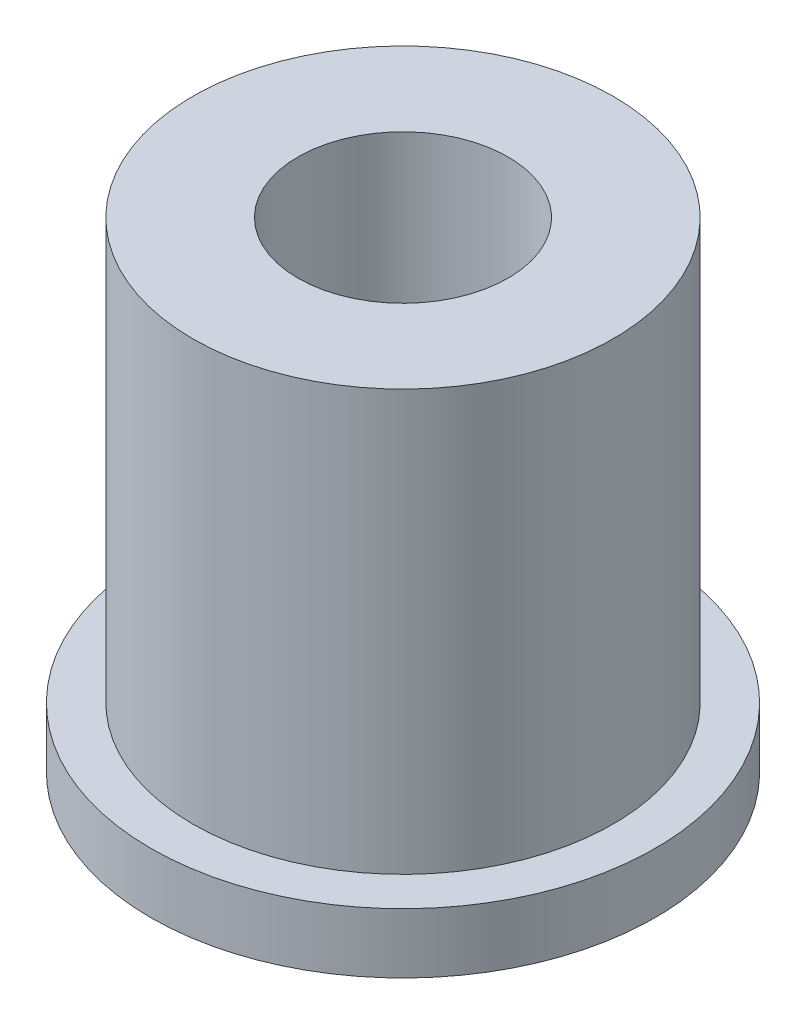
ISO-10303-21;
HEADER;
FILE_DESCRIPTION(('STEP AP214'),'2;1');
FILE_NAME('part.step','',(''),(''),'','','');
FILE_SCHEMA(('AUTOMOTIVE_DESIGN { 1 0 10303 214 1 1 1 1 }'));
ENDSEC;
DATA;
#1=APPLICATION_CONTEXT('core data for automotive mechanical design processes');
#2=APPLICATION_PROTOCOL_DEFINITION('international standard','automotive_design',2000,#1);
#3=PRODUCT_CONTEXT('',#1,'mechanical');
#4=PRODUCT('Part','Part','',(#3));
#5=PRODUCT_RELATED_PRODUCT_CATEGORY('part','',(#4));
#6=PRODUCT_DEFINITION_FORMATION('','',#4);
#7=PRODUCT_DEFINITION_CONTEXT('part definition',#1,'design');
#8=PRODUCT_DEFINITION('design','',#6,#7);
#9=PRODUCT_DEFINITION_SHAPE('','',#8);
#10=(LENGTH_UNIT() NAMED_UNIT(*) SI_UNIT(.MILLI.,.METRE.));
#11=(NAMED_UNIT(*) PLANE_ANGLE_UNIT() SI_UNIT($,.RADIAN.));
#12=(NAMED_UNIT(*) SI_UNIT($,.STERADIAN.) SOLID_ANGLE_UNIT());
#13=UNCERTAINTY_MEASURE_WITH_UNIT(LENGTH_MEASURE(1.E-05),#10,'distance_accuracy_value','');
#14=(GEOMETRIC_REPRESENTATION_CONTEXT(3) GLOBAL_UNCERTAINTY_ASSIGNED_CONTEXT((#13)) GLOBAL_UNIT_ASSIGNED_CONTEXT((#10,
#11,#12)) REPRESENTATION_CONTEXT('',''));
#15=CARTESIAN_POINT('',(0.,0.,0.));
#16=DIRECTION('',(0.,0.,1.));
#17=DIRECTION('',(1.,0.,0.));
#18=AXIS2_PLACEMENT_3D('',#15,#16,#17);
#19=CARTESIAN_POINT('',(0.,5.,0.));
#20=DIRECTION('',(0.,1.,0.));
#21=DIRECTION('',(0.,0.,1.));
#22=AXIS2_PLACEMENT_3D('',#19,#20,#21);
#23=PLANE('',#22);
#24=CARTESIAN_POINT('',(0.,5.,0.));
#25=DIRECTION('',(0.,1.,0.));
#26=DIRECTION('',(0.,0.,1.));
#27=AXIS2_PLACEMENT_3D('',#24,#25,#26);
#28=CIRCLE('',#27,21.);
#29=CARTESIAN_POINT('',(0.,5.,21.));
#30=VERTEX_POINT('',#29);
#31=EDGE_CURVE('E10',#30,#30,#28,.T.);
#32=ORIENTED_EDGE('',*,*,#31,.T.);
#33=EDGE_LOOP('',(#32));
#34=FACE_BOUND('',#33,.T.);
#35=CARTESIAN_POINT('',(0.,5.,0.));
#36=DIRECTION('',(0.,1.,0.));
#37=DIRECTION('',(0.,0.,1.));
#38=AXIS2_PLACEMENT_3D('',#35,#36,#37);
#39=CIRCLE('',#38,17.5);
#40=CARTESIAN_POINT('',(0.,5.,17.5));
#41=VERTEX_POINT('',#40);
#42=EDGE_CURVE('E88',#41,#41,#39,.T.);
#43=ORIENTED_EDGE('',*,*,#42,.F.);
#44=EDGE_LOOP('',(#43));
#45=FACE_BOUND('',#44,.T.);
#46=ADVANCED_FACE('F30',(#34,#45),#23,.T.);
#47=CARTESIAN_POINT('',(0.,0.,0.));
#48=DIRECTION('',(0.,1.,0.));
#49=DIRECTION('',(0.,0.,1.));
#50=AXIS2_PLACEMENT_3D('',#47,#48,#49);
#51=PLANE('',#50);
#52=CARTESIAN_POINT('',(-8.83883476483189,0.,-8.8388347648318));
#53=DIRECTION('',(0.,-1.,0.));
#54=DIRECTION('',(0.,0.,-1.));
#55=AXIS2_PLACEMENT_3D('',#52,#53,#54);
#56=CIRCLE('',#55,1.6);
#57=CARTESIAN_POINT('',(-8.83883476483189,0.,-10.4388347648318));
#58=VERTEX_POINT('',#57);
#59=EDGE_CURVE('E82',#58,#58,#56,.T.);
#60=ORIENTED_EDGE('',*,*,#59,.F.);
#61=EDGE_LOOP('',(#60));
#62=FACE_BOUND('',#61,.T.);
#63=CARTESIAN_POINT('',(8.83883476483189,0.,8.83883476483179));
#64=DIRECTION('',(0.,-1.,0.));
#65=DIRECTION('',(0.,0.,-1.));
#66=AXIS2_PLACEMENT_3D('',#63,#64,#65);
#67=CIRCLE('',#66,1.6);
#68=CARTESIAN_POINT('',(8.83883476483189,0.,7.23883476483179));
#69=VERTEX_POINT('',#68);
#70=EDGE_CURVE('E76',#69,#69,#67,.T.);
#71=ORIENTED_EDGE('',*,*,#70,.F.);
#72=EDGE_LOOP('',(#71));
#73=FACE_BOUND('',#72,.T.);
#74=CARTESIAN_POINT('',(7.49999999999988,0.,-12.9903810567667));
#75=DIRECTION('',(0.,-1.,0.));
#76=DIRECTION('',(0.,0.,-1.));
#77=AXIS2_PLACEMENT_3D('',#74,#75,#76);
#78=CIRCLE('',#77,1.6);
#79=CARTESIAN_POINT('',(7.49999999999988,0.,-14.5903810567667));
#80=VERTEX_POINT('',#79);
#81=EDGE_CURVE('E70',#80,#80,#78,.T.);
#82=ORIENTED_EDGE('',*,*,#81,.F.);
#83=EDGE_LOOP('',(#82));
#84=FACE_BOUND('',#83,.T.);
#85=CARTESIAN_POINT('',(7.50000000000006,0.,12.9903810567665));
#86=DIRECTION('',(0.,-1.,0.));
#87=DIRECTION('',(0.,0.,-1.));
#88=AXIS2_PLACEMENT_3D('',#85,#86,#87);
#89=CIRCLE('',#88,1.6);
#90=CARTESIAN_POINT('',(7.50000000000006,0.,11.3903810567665));
#91=VERTEX_POINT('',#90);
#92=EDGE_CURVE('E64',#91,#91,#89,.T.);
#93=ORIENTED_EDGE('',*,*,#92,.F.);
#94=EDGE_LOOP('',(#93));
#95=FACE_BOUND('',#94,.T.);
#96=CARTESIAN_POINT('',(-15.,0.,0.));
#97=DIRECTION('',(0.,-1.,0.));
#98=DIRECTION('',(0.,0.,-1.));
#99=AXIS2_PLACEMENT_3D('',#96,#97,#98);
#100=CIRCLE('',#99,1.6);
#101=CARTESIAN_POINT('',(-15.,0.,-1.6));
#102=VERTEX_POINT('',#101);
#103=EDGE_CURVE('E58',#102,#102,#100,.T.);
#104=ORIENTED_EDGE('',*,*,#103,.F.);
#105=EDGE_LOOP('',(#104));
#106=FACE_BOUND('',#105,.T.);
#107=CARTESIAN_POINT('',(10.2530483272049,0.,-10.253048327205));
#108=DIRECTION('',(0.,-1.,0.));
#109=DIRECTION('',(0.,0.,-1.));
#110=AXIS2_PLACEMENT_3D('',#107,#108,#109);
#111=CIRCLE('',#110,2.1);
#112=CARTESIAN_POINT('',(10.2530483272049,0.,-12.353048327205));
#113=VERTEX_POINT('',#112);
#114=EDGE_CURVE('E52',#113,#113,#111,.T.);
#115=ORIENTED_EDGE('',*,*,#114,.F.);
#116=EDGE_LOOP('',(#115));
#117=FACE_BOUND('',#116,.T.);
#118=CARTESIAN_POINT('',(-10.2530483272049,0.,10.253048327205));
#119=DIRECTION('',(0.,-1.,0.));
#120=DIRECTION('',(0.,0.,-1.));
#121=AXIS2_PLACEMENT_3D('',#118,#119,#120);
#122=CIRCLE('',#121,2.1);
#123=CARTESIAN_POINT('',(-10.2530483272049,0.,8.15304832720495));
#124=VERTEX_POINT('',#123);
#125=EDGE_CURVE('E46',#124,#124,#122,.T.);
#126=ORIENTED_EDGE('',*,*,#125,.F.);
#127=EDGE_LOOP('',(#126));
#128=FACE_BOUND('',#127,.T.);
#129=CARTESIAN_POINT('',(0.,0.,0.));
#130=DIRECTION('',(0.,1.,0.));
#131=DIRECTION('',(0.,0.,1.));
#132=AXIS2_PLACEMENT_3D('',#129,#130,#131);
#133=CIRCLE('',#132,21.);
#134=CARTESIAN_POINT('',(0.,0.,21.));
#135=VERTEX_POINT('',#134);
#136=EDGE_CURVE('E34',#135,#135,#133,.T.);
#137=ORIENTED_EDGE('',*,*,#136,.F.);
#138=EDGE_LOOP('',(#137));
#139=FACE_BOUND('',#138,.T.);
#140=CARTESIAN_POINT('',(0.,0.,0.));
#141=DIRECTION('',(0.,1.,0.));
#142=DIRECTION('',(0.,0.,1.));
#143=AXIS2_PLACEMENT_3D('',#140,#141,#142);
#144=CIRCLE('',#143,8.75);
#145=CARTESIAN_POINT('',(0.,0.,8.75));
#146=VERTEX_POINT('',#145);
#147=EDGE_CURVE('E41',#146,#146,#144,.T.);
#148=ORIENTED_EDGE('',*,*,#147,.T.);
#149=EDGE_LOOP('',(#148));
#150=FACE_BOUND('',#149,.T.);
#151=ADVANCED_FACE('F116',(#62,#73,#84,#95,#106,#117,#128,#139,#150),#51,.F.);
#152=CARTESIAN_POINT('',(0.,5.,0.));
#153=DIRECTION('',(0.,-1.,0.));
#154=DIRECTION('',(0.,0.,-1.));
#155=AXIS2_PLACEMENT_3D('',#152,#153,#154);
#156=CYLINDRICAL_SURFACE('',#155,21.);
#157=ORIENTED_EDGE('',*,*,#31,.F.);
#158=EDGE_LOOP('',(#157));
#159=FACE_BOUND('',#158,.T.);
#160=ORIENTED_EDGE('',*,*,#136,.T.);
#161=EDGE_LOOP('',(#160));
#162=FACE_BOUND('',#161,.T.);
#163=ADVANCED_FACE('F32',(#159,#162),#156,.T.);
#164=CARTESIAN_POINT('',(0.,5.,0.));
#165=DIRECTION('',(0.,-1.,0.));
#166=DIRECTION('',(0.,0.,-1.));
#167=AXIS2_PLACEMENT_3D('',#164,#165,#166);
#168=CYLINDRICAL_SURFACE('',#167,8.75);
#169=ORIENTED_EDGE('',*,*,#147,.F.);
#170=EDGE_LOOP('',(#169));
#171=FACE_BOUND('',#170,.T.);
#172=CARTESIAN_POINT('',(0.,40.,0.));
#173=DIRECTION('',(0.,1.,0.));
#174=DIRECTION('',(0.,0.,1.));
#175=AXIS2_PLACEMENT_3D('',#172,#173,#174);
#176=CIRCLE('',#175,8.75);
#177=CARTESIAN_POINT('',(0.,40.,8.75));
#178=VERTEX_POINT('',#177);
#179=EDGE_CURVE('E91',#178,#178,#176,.T.);
#180=ORIENTED_EDGE('',*,*,#179,.T.);
#181=EDGE_LOOP('',(#180));
#182=FACE_BOUND('',#181,.T.);
#183=ADVANCED_FACE('F97',(#171,#182),#168,.F.);
#184=CARTESIAN_POINT('',(-10.2530483272049,5.,10.253048327205));
#185=DIRECTION('',(0.,-1.,0.));
#186=DIRECTION('',(0.,0.,-1.));
#187=AXIS2_PLACEMENT_3D('',#184,#185,#186);
#188=CYLINDRICAL_SURFACE('',#187,2.1);
#189=CARTESIAN_POINT('',(-10.2530483272049,5.,10.253048327205));
#190=DIRECTION('',(0.,-1.,0.));
#191=DIRECTION('',(0.,0.,-1.));
#192=AXIS2_PLACEMENT_3D('',#189,#190,#191);
#193=CIRCLE('',#192,2.1);
#194=CARTESIAN_POINT('',(-10.2530483272049,5.,8.15304832720495));
#195=VERTEX_POINT('',#194);
#196=EDGE_CURVE('E45',#195,#195,#193,.T.);
#197=ORIENTED_EDGE('',*,*,#196,.F.);
#198=EDGE_LOOP('',(#197));
#199=FACE_BOUND('',#198,.T.);
#200=ORIENTED_EDGE('',*,*,#125,.T.);
#201=EDGE_LOOP('',(#200));
#202=FACE_BOUND('',#201,.T.);
#203=ADVANCED_FACE('F126',(#199,#202),#188,.F.);
#204=CARTESIAN_POINT('',(10.2530483272049,5.,-10.253048327205));
#205=DIRECTION('',(0.,-1.,0.));
#206=DIRECTION('',(0.,0.,-1.));
#207=AXIS2_PLACEMENT_3D('',#204,#205,#206);
#208=CYLINDRICAL_SURFACE('',#207,2.1);
#209=CARTESIAN_POINT('',(10.2530483272049,5.,-10.253048327205));
#210=DIRECTION('',(0.,-1.,0.));
#211=DIRECTION('',(0.,0.,-1.));
#212=AXIS2_PLACEMENT_3D('',#209,#210,#211);
#213=CIRCLE('',#212,2.1);
#214=CARTESIAN_POINT('',(10.2530483272049,5.,-12.353048327205));
#215=VERTEX_POINT('',#214);
#216=EDGE_CURVE('E49',#215,#215,#213,.T.);
#217=ORIENTED_EDGE('',*,*,#216,.F.);
#218=EDGE_LOOP('',(#217));
#219=FACE_BOUND('',#218,.T.);
#220=ORIENTED_EDGE('',*,*,#114,.T.);
#221=EDGE_LOOP('',(#220));
#222=FACE_BOUND('',#221,.T.);
#223=ADVANCED_FACE('F130',(#219,#222),#208,.F.);
#224=CARTESIAN_POINT('',(-15.,5.,0.));
#225=DIRECTION('',(0.,-1.,0.));
#226=DIRECTION('',(0.,0.,-1.));
#227=AXIS2_PLACEMENT_3D('',#224,#225,#226);
#228=CYLINDRICAL_SURFACE('',#227,1.6);
#229=CARTESIAN_POINT('',(-15.,5.,0.));
#230=DIRECTION('',(0.,-1.,0.));
#231=DIRECTION('',(0.,0.,-1.));
#232=AXIS2_PLACEMENT_3D('',#229,#230,#231);
#233=CIRCLE('',#232,1.6);
#234=CARTESIAN_POINT('',(-15.,5.,-1.6));
#235=VERTEX_POINT('',#234);
#236=EDGE_CURVE('E55',#235,#235,#233,.T.);
#237=ORIENTED_EDGE('',*,*,#236,.F.);
#238=EDGE_LOOP('',(#237));
#239=FACE_BOUND('',#238,.T.);
#240=ORIENTED_EDGE('',*,*,#103,.T.);
#241=EDGE_LOOP('',(#240));
#242=FACE_BOUND('',#241,.T.);
#243=ADVANCED_FACE('F134',(#239,#242),#228,.F.);
#244=CARTESIAN_POINT('',(7.50000000000006,5.,12.9903810567665));
#245=DIRECTION('',(0.,-1.,0.));
#246=DIRECTION('',(0.,0.,-1.));
#247=AXIS2_PLACEMENT_3D('',#244,#245,#246);
#248=CYLINDRICAL_SURFACE('',#247,1.6);
#249=CARTESIAN_POINT('',(7.50000000000006,5.,12.9903810567665));
#250=DIRECTION('',(0.,-1.,0.));
#251=DIRECTION('',(0.,0.,-1.));
#252=AXIS2_PLACEMENT_3D('',#249,#250,#251);
#253=CIRCLE('',#252,1.6);
#254=CARTESIAN_POINT('',(7.50000000000006,5.,11.3903810567665));
#255=VERTEX_POINT('',#254);
#256=EDGE_CURVE('E61',#255,#255,#253,.T.);
#257=ORIENTED_EDGE('',*,*,#256,.F.);
#258=EDGE_LOOP('',(#257));
#259=FACE_BOUND('',#258,.T.);
#260=ORIENTED_EDGE('',*,*,#92,.T.);
#261=EDGE_LOOP('',(#260));
#262=FACE_BOUND('',#261,.T.);
#263=ADVANCED_FACE('F138',(#259,#262),#248,.F.);
#264=CARTESIAN_POINT('',(7.49999999999988,5.,-12.9903810567667));
#265=DIRECTION('',(0.,-1.,0.));
#266=DIRECTION('',(0.,0.,-1.));
#267=AXIS2_PLACEMENT_3D('',#264,#265,#266);
#268=CYLINDRICAL_SURFACE('',#267,1.6);
#269=CARTESIAN_POINT('',(7.49999999999988,5.,-12.9903810567667));
#270=DIRECTION('',(0.,-1.,0.));
#271=DIRECTION('',(0.,0.,-1.));
#272=AXIS2_PLACEMENT_3D('',#269,#270,#271);
#273=CIRCLE('',#272,1.6);
#274=CARTESIAN_POINT('',(7.49999999999988,5.,-14.5903810567667));
#275=VERTEX_POINT('',#274);
#276=EDGE_CURVE('E67',#275,#275,#273,.T.);
#277=ORIENTED_EDGE('',*,*,#276,.F.);
#278=EDGE_LOOP('',(#277));
#279=FACE_BOUND('',#278,.T.);
#280=ORIENTED_EDGE('',*,*,#81,.T.);
#281=EDGE_LOOP('',(#280));
#282=FACE_BOUND('',#281,.T.);
#283=ADVANCED_FACE('F142',(#279,#282),#268,.F.);
#284=CARTESIAN_POINT('',(8.83883476483189,5.,8.83883476483179));
#285=DIRECTION('',(0.,-1.,0.));
#286=DIRECTION('',(0.,0.,-1.));
#287=AXIS2_PLACEMENT_3D('',#284,#285,#286);
#288=CYLINDRICAL_SURFACE('',#287,1.6);
#289=CARTESIAN_POINT('',(8.83883476483189,5.,8.83883476483179));
#290=DIRECTION('',(0.,-1.,0.));
#291=DIRECTION('',(0.,0.,-1.));
#292=AXIS2_PLACEMENT_3D('',#289,#290,#291);
#293=CIRCLE('',#292,1.6);
#294=CARTESIAN_POINT('',(8.83883476483189,5.,7.23883476483179));
#295=VERTEX_POINT('',#294);
#296=EDGE_CURVE('E73',#295,#295,#293,.T.);
#297=ORIENTED_EDGE('',*,*,#296,.F.);
#298=EDGE_LOOP('',(#297));
#299=FACE_BOUND('',#298,.T.);
#300=ORIENTED_EDGE('',*,*,#70,.T.);
#301=EDGE_LOOP('',(#300));
#302=FACE_BOUND('',#301,.T.);
#303=ADVANCED_FACE('F146',(#299,#302),#288,.F.);
#304=CARTESIAN_POINT('',(-8.83883476483189,5.,-8.8388347648318));
#305=DIRECTION('',(0.,-1.,0.));
#306=DIRECTION('',(0.,0.,-1.));
#307=AXIS2_PLACEMENT_3D('',#304,#305,#306);
#308=CYLINDRICAL_SURFACE('',#307,1.6);
#309=CARTESIAN_POINT('',(-8.83883476483189,5.,-8.8388347648318));
#310=DIRECTION('',(0.,-1.,0.));
#311=DIRECTION('',(0.,0.,-1.));
#312=AXIS2_PLACEMENT_3D('',#309,#310,#311);
#313=CIRCLE('',#312,1.6);
#314=CARTESIAN_POINT('',(-8.83883476483189,5.,-10.4388347648318));
#315=VERTEX_POINT('',#314);
#316=EDGE_CURVE('E79',#315,#315,#313,.T.);
#317=ORIENTED_EDGE('',*,*,#316,.F.);
#318=EDGE_LOOP('',(#317));
#319=FACE_BOUND('',#318,.T.);
#320=ORIENTED_EDGE('',*,*,#59,.T.);
#321=EDGE_LOOP('',(#320));
#322=FACE_BOUND('',#321,.T.);
#323=ADVANCED_FACE('F150',(#319,#322),#308,.F.);
#324=CARTESIAN_POINT('',(0.,5.,0.));
#325=DIRECTION('',(0.,1.,0.));
#326=DIRECTION('',(0.,0.,1.));
#327=AXIS2_PLACEMENT_3D('',#324,#325,#326);
#328=PLANE('',#327);
#329=ORIENTED_EDGE('',*,*,#316,.T.);
#330=EDGE_LOOP('',(#329));
#331=FACE_BOUND('',#330,.T.);
#332=ADVANCED_FACE('F114',(#331),#328,.F.);
#333=ORIENTED_EDGE('',*,*,#296,.T.);
#334=EDGE_LOOP('',(#333));
#335=FACE_BOUND('',#334,.T.);
#336=ADVANCED_FACE('F157',(#335),#328,.F.);
#337=ORIENTED_EDGE('',*,*,#276,.T.);
#338=EDGE_LOOP('',(#337));
#339=FACE_BOUND('',#338,.T.);
#340=ADVANCED_FACE('F241',(#339),#328,.F.);
#341=ORIENTED_EDGE('',*,*,#256,.T.);
#342=EDGE_LOOP('',(#341));
#343=FACE_BOUND('',#342,.T.);
#344=ADVANCED_FACE('F249',(#343),#328,.F.);
#345=ORIENTED_EDGE('',*,*,#236,.T.);
#346=EDGE_LOOP('',(#345));
#347=FACE_BOUND('',#346,.T.);
#348=ADVANCED_FACE('F257',(#347),#328,.F.);
#349=ORIENTED_EDGE('',*,*,#216,.T.);
#350=EDGE_LOOP('',(#349));
#351=FACE_BOUND('',#350,.T.);
#352=ADVANCED_FACE('F111',(#351),#328,.F.);
#353=ORIENTED_EDGE('',*,*,#196,.T.);
#354=EDGE_LOOP('',(#353));
#355=FACE_BOUND('',#354,.T.);
#356=ADVANCED_FACE('F102',(#355),#328,.F.);
#357=CARTESIAN_POINT('',(0.,40.,0.));
#358=DIRECTION('',(0.,1.,0.));
#359=DIRECTION('',(0.,0.,1.));
#360=AXIS2_PLACEMENT_3D('',#357,#358,#359);
#361=PLANE('',#360);
#362=CARTESIAN_POINT('',(0.,40.,0.));
#363=DIRECTION('',(0.,1.,0.));
#364=DIRECTION('',(0.,0.,1.));
#365=AXIS2_PLACEMENT_3D('',#362,#363,#364);
#366=CIRCLE('',#365,17.5);
#367=CARTESIAN_POINT('',(0.,40.,17.5));
#368=VERTEX_POINT('',#367);
#369=EDGE_CURVE('E85',#368,#368,#366,.T.);
#370=ORIENTED_EDGE('',*,*,#369,.T.);
#371=EDGE_LOOP('',(#370));
#372=FACE_BOUND('',#371,.T.);
#373=ORIENTED_EDGE('',*,*,#179,.F.);
#374=EDGE_LOOP('',(#373));
#375=FACE_BOUND('',#374,.T.);
#376=ADVANCED_FACE('F99',(#372,#375),#361,.T.);
#377=CARTESIAN_POINT('',(0.,40.,0.));
#378=DIRECTION('',(0.,-1.,0.));
#379=DIRECTION('',(0.,0.,-1.));
#380=AXIS2_PLACEMENT_3D('',#377,#378,#379);
#381=CYLINDRICAL_SURFACE('',#380,17.5);
#382=ORIENTED_EDGE('',*,*,#369,.F.);
#383=EDGE_LOOP('',(#382));
#384=FACE_BOUND('',#383,.T.);
#385=ORIENTED_EDGE('',*,*,#42,.T.);
#386=EDGE_LOOP('',(#385));
#387=FACE_BOUND('',#386,.T.);
#388=ADVANCED_FACE('F101',(#384,#387),#381,.T.);
#389=CLOSED_SHELL('',(#46,#151,#163,#183,#203,#223,#243,#263,#283,#303,#323,#332,#336,#340,#344,
#348,#352,#356,#376,#388));
#390=MANIFOLD_SOLID_BREP('B2',#389);
#391=ADVANCED_BREP_SHAPE_REPRESENTATION('',(#18,#390),#14);
#392=SHAPE_DEFINITION_REPRESENTATION(#9,#391);
ENDSEC;
END-ISO-10303-21;
